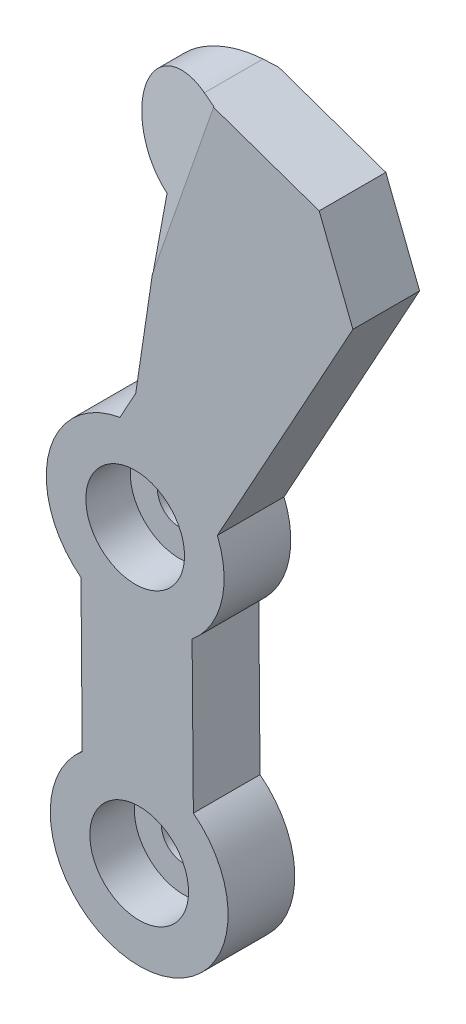
ISO-10303-21;
HEADER;
FILE_DESCRIPTION(('STEP AP214'),'2;1');
FILE_NAME('part.step','',(''),(''),'','','');
FILE_SCHEMA(('AUTOMOTIVE_DESIGN { 1 0 10303 214 1 1 1 1 }'));
ENDSEC;
DATA;
#1=APPLICATION_CONTEXT('core data for automotive mechanical design processes');
#2=APPLICATION_PROTOCOL_DEFINITION('international standard','automotive_design',2000,#1);
#3=PRODUCT_CONTEXT('',#1,'mechanical');
#4=PRODUCT('Part','Part','',(#3));
#5=PRODUCT_RELATED_PRODUCT_CATEGORY('part','',(#4));
#6=PRODUCT_DEFINITION_FORMATION('','',#4);
#7=PRODUCT_DEFINITION_CONTEXT('part definition',#1,'design');
#8=PRODUCT_DEFINITION('design','',#6,#7);
#9=PRODUCT_DEFINITION_SHAPE('','',#8);
#10=(LENGTH_UNIT() NAMED_UNIT(*) SI_UNIT(.MILLI.,.METRE.));
#11=(NAMED_UNIT(*) PLANE_ANGLE_UNIT() SI_UNIT($,.RADIAN.));
#12=(NAMED_UNIT(*) SI_UNIT($,.STERADIAN.) SOLID_ANGLE_UNIT());
#13=UNCERTAINTY_MEASURE_WITH_UNIT(LENGTH_MEASURE(1.E-05),#10,'distance_accuracy_value','');
#14=(GEOMETRIC_REPRESENTATION_CONTEXT(3) GLOBAL_UNCERTAINTY_ASSIGNED_CONTEXT((#13)) GLOBAL_UNIT_ASSIGNED_CONTEXT((#10,
#11,#12)) REPRESENTATION_CONTEXT('',''));
#15=CARTESIAN_POINT('',(0.,0.,0.));
#16=DIRECTION('',(0.,0.,1.));
#17=DIRECTION('',(1.,0.,0.));
#18=AXIS2_PLACEMENT_3D('',#15,#16,#17);
#19=CARTESIAN_POINT('',(40.5387405240071,99.7887515998659,15.));
#20=DIRECTION('',(-0.329855903742735,-0.944031293319275,0.));
#21=DIRECTION('',(0.944031293319275,-0.329855903742735,0.));
#22=AXIS2_PLACEMENT_3D('',#19,#20,#21);
#23=PLANE('',#22);
#24=DIRECTION('',(0.350651647617486,-0.122521908905224,0.928456678505445));
#25=VECTOR('',#24,1.);
#26=CARTESIAN_POINT('',(12.7019287820053,109.515268887433,-9.1993788166737));
#27=LINE('',#26,#25);
#28=CARTESIAN_POINT('',(16.1762721884382,108.301291456439,0.));
#29=VERTEX_POINT('',#28);
#30=CARTESIAN_POINT('',(16.2084452581801,108.290049798381,0.085187968380751));
#31=VERTEX_POINT('',#30);
#32=EDGE_CURVE('E56',#29,#31,#27,.T.);
#33=ORIENTED_EDGE('',*,*,#32,.T.);
#34=DIRECTION('',(-0.876492159000414,0.306256916774391,0.371440703395087));
#35=VECTOR('',#34,1.);
#36=CARTESIAN_POINT('',(16.2084452581801,108.290049798381,0.085187968380751));
#37=LINE('',#36,#35);
#38=CARTESIAN_POINT('',(13.9405368470469,109.082484311786,1.04628441039305));
#39=VERTEX_POINT('',#38);
#40=EDGE_CURVE('E164',#31,#39,#37,.T.);
#41=ORIENTED_EDGE('',*,*,#40,.T.);
#42=DIRECTION('',(0.,0.,-1.));
#43=VECTOR('',#42,1.);
#44=CARTESIAN_POINT('',(13.9405368470313,109.082484311791,15.));
#45=LINE('',#44,#43);
#46=CARTESIAN_POINT('',(13.9405368470469,109.082484311786,14.20433006524));
#47=VERTEX_POINT('',#46);
#48=EDGE_CURVE('E163',#47,#39,#45,.T.);
#49=ORIENTED_EDGE('',*,*,#48,.F.);
#50=DIRECTION('',(0.921073236849906,-0.321834082306866,0.219196067082723));
#51=VECTOR('',#50,1.);
#52=CARTESIAN_POINT('',(-0.0491900635557138,113.970663385792,10.8750691599369));
#53=LINE('',#52,#51);
#54=CARTESIAN_POINT('',(16.8139855879223,108.078466714077,14.8881504584129));
#55=VERTEX_POINT('',#54);
#56=EDGE_CURVE('E148',#47,#55,#53,.T.);
#57=ORIENTED_EDGE('',*,*,#56,.T.);
#58=DIRECTION('',(-0.206927946698601,0.0723031168044244,0.975680831099734));
#59=VECTOR('',#58,1.);
#60=CARTESIAN_POINT('',(16.8139855879223,108.078466714077,14.8881504584129));
#61=LINE('',#60,#59);
#62=CARTESIAN_POINT('',(16.7902639002125,108.086755357466,15.));
#63=VERTEX_POINT('',#62);
#64=EDGE_CURVE('E154',#55,#63,#61,.T.);
#65=ORIENTED_EDGE('',*,*,#64,.T.);
#66=DIRECTION('',(-0.944031293319275,0.329855903742735,0.));
#67=VECTOR('',#66,1.);
#68=CARTESIAN_POINT('',(40.5387405240071,99.7887515998659,15.));
#69=LINE('',#68,#67);
#70=CARTESIAN_POINT('',(40.5387405240071,99.7887515998659,15.));
#71=VERTEX_POINT('',#70);
#72=EDGE_CURVE('E209',#71,#63,#69,.T.);
#73=ORIENTED_EDGE('',*,*,#72,.F.);
#74=DIRECTION('',(0.,0.,-1.));
#75=VECTOR('',#74,1.);
#76=CARTESIAN_POINT('',(40.5387405240071,99.7887515998659,15.));
#77=LINE('',#76,#75);
#78=CARTESIAN_POINT('',(40.5387405240071,99.7887515998659,0.));
#79=VERTEX_POINT('',#78);
#80=EDGE_CURVE('E279',#71,#79,#77,.T.);
#81=ORIENTED_EDGE('',*,*,#80,.T.);
#82=DIRECTION('',(-0.944031293319275,0.329855903742735,0.));
#83=VECTOR('',#82,1.);
#84=CARTESIAN_POINT('',(40.5387405240071,99.7887515998659,0.));
#85=LINE('',#84,#83);
#86=EDGE_CURVE('E231',#79,#29,#85,.T.);
#87=ORIENTED_EDGE('',*,*,#86,.T.);
#88=EDGE_LOOP('',(#33,#41,#49,#57,#65,#73,#81,#87));
#89=FACE_BOUND('',#88,.T.);
#90=ADVANCED_FACE('F33',(#89),#23,.F.);
#91=CARTESIAN_POINT('',(9.84138893483783,97.1588665920305,15.));
#92=DIRECTION('',(0.,0.,-1.));
#93=DIRECTION('',(-1.,0.,0.));
#94=AXIS2_PLACEMENT_3D('',#91,#92,#93);
#95=CYLINDRICAL_SURFACE('',#94,12.6085555529975);
#96=CARTESIAN_POINT('',(9.84138893483783,97.1588665920305,1.0209397331653));
#97=DIRECTION('',(-0.350651647617486,0.122521908905224,-0.928456678505445));
#98=DIRECTION('',(0.876492159000414,-0.306256916774391,-0.371440703395087));
#99=AXIS2_PLACEMENT_3D('',#96,#97,#98);
#100=ELLIPSE('',#99,13.5801226324246,12.6085555529975);
#101=CARTESIAN_POINT('',(5.30776865440436,85.3935803530193,1.18057679067951));
#102=VERTEX_POINT('',#101);
#103=EDGE_CURVE('E179',#102,#39,#100,.T.);
#104=ORIENTED_EDGE('',*,*,#103,.F.);
#105=DIRECTION('',(0.,0.,-1.));
#106=VECTOR('',#105,1.);
#107=CARTESIAN_POINT('',(5.30776865440436,85.3935803530193,15.));
#108=LINE('',#107,#106);
#109=CARTESIAN_POINT('',(5.30776865440436,85.3935803530193,14.1289166675553));
#110=VERTEX_POINT('',#109);
#111=EDGE_CURVE('E275',#110,#102,#108,.T.);
#112=ORIENTED_EDGE('',*,*,#111,.F.);
#113=CARTESIAN_POINT('',(9.84138893483783,97.1588665920305,14.2185626540056));
#114=DIRECTION('',(-0.206927946698601,0.0723031168044247,0.975680831099733));
#115=DIRECTION('',(-0.921073236849907,0.321834082306865,-0.219196067082723));
#116=AXIS2_PLACEMENT_3D('',#113,#114,#115);
#117=ELLIPSE('',#116,12.9228279895443,12.6085555529975);
#118=EDGE_CURVE('E175',#47,#110,#117,.T.);
#119=ORIENTED_EDGE('',*,*,#118,.F.);
#120=ORIENTED_EDGE('',*,*,#48,.T.);
#121=EDGE_LOOP('',(#104,#112,#119,#120));
#122=FACE_BOUND('',#121,.T.);
#123=ADVANCED_FACE('F347',(#122),#95,.T.);
#124=CARTESIAN_POINT('',(5.50581694547402,85.3260122167898,15.));
#125=DIRECTION('',(0.322895145350246,0.946434744242435,0.));
#126=DIRECTION('',(-0.946434744242435,0.322895145350246,0.));
#127=AXIS2_PLACEMENT_3D('',#124,#125,#126);
#128=PLANE('',#127);
#129=DIRECTION('',(-0.878726946270524,0.299795275654544,0.371432021496931));
#130=VECTOR('',#129,1.);
#131=CARTESIAN_POINT('',(0.968009269216061,86.8741760792329,3.01496414854087));
#132=LINE('',#131,#130);
#133=CARTESIAN_POINT('',(5.50581694547402,85.3260122167898,1.09686309848169));
#134=VERTEX_POINT('',#133);
#135=EDGE_CURVE('E177',#134,#102,#132,.T.);
#136=ORIENTED_EDGE('',*,*,#135,.F.);
#137=DIRECTION('',(0.,0.,-1.));
#138=VECTOR('',#137,1.);
#139=CARTESIAN_POINT('',(5.50581694547402,85.3260122167898,15.));
#140=LINE('',#139,#138);
#141=CARTESIAN_POINT('',(5.50581694547403,85.3260122167898,14.1759270336528));
#142=VERTEX_POINT('',#141);
#143=EDGE_CURVE('E272',#142,#134,#140,.T.);
#144=ORIENTED_EDGE('',*,*,#143,.F.);
#145=DIRECTION('',(0.92341944082408,-0.315043014194074,0.219190409269329));
#146=VECTOR('',#145,1.);
#147=CARTESIAN_POINT('',(5.67261317477762,85.2691063465937,14.2155191541447));
#148=LINE('',#147,#146);
#149=EDGE_CURVE('E173',#110,#142,#148,.T.);
#150=ORIENTED_EDGE('',*,*,#149,.F.);
#151=ORIENTED_EDGE('',*,*,#111,.T.);
#152=EDGE_LOOP('',(#136,#144,#150,#151));
#153=FACE_BOUND('',#152,.T.);
#154=ADVANCED_FACE('F343',(#153),#128,.F.);
#155=CARTESIAN_POINT('',(5.50581694547402,85.3260122167898,15.));
#156=DIRECTION('',(0.989057231211688,-0.147532346920497,0.));
#157=DIRECTION('',(0.147532346920497,0.989057231211688,0.));
#158=AXIS2_PLACEMENT_3D('',#155,#156,#157);
#159=PLANE('',#158);
#160=DIRECTION('',(-0.133656048191534,-0.896030489030661,0.423397476975593));
#161=VECTOR('',#160,1.);
#162=CARTESIAN_POINT('',(4.3040904643151,77.2696348125225,-2.42896025397282));
#163=LINE('',#162,#161);
#164=CARTESIAN_POINT('',(3.53732815132414,72.129258304495,0.));
#165=VERTEX_POINT('',#164);
#166=CARTESIAN_POINT('',(3.51043642941656,71.9489761320248,0.0851879683807523));
#167=VERTEX_POINT('',#166);
#168=EDGE_CURVE('E169',#165,#167,#163,.T.);
#169=ORIENTED_EDGE('',*,*,#168,.F.);
#170=DIRECTION('',(-0.147532346920497,-0.989057231211688,0.));
#171=VECTOR('',#170,1.);
#172=CARTESIAN_POINT('',(5.50581694547402,85.3260122167898,0.));
#173=LINE('',#172,#171);
#174=CARTESIAN_POINT('',(-0.715580359542119,43.6177487667205,0.));
#175=VERTEX_POINT('',#174);
#176=EDGE_CURVE('E234',#165,#175,#173,.T.);
#177=ORIENTED_EDGE('',*,*,#176,.T.);
#178=DIRECTION('',(0.,0.,-1.));
#179=VECTOR('',#178,1.);
#180=CARTESIAN_POINT('',(-0.715580359542119,43.6177487667205,15.));
#181=LINE('',#180,#179);
#182=CARTESIAN_POINT('',(-0.715580359542119,43.6177487667205,15.));
#183=VERTEX_POINT('',#182);
#184=EDGE_CURVE('E269',#183,#175,#181,.T.);
#185=ORIENTED_EDGE('',*,*,#184,.F.);
#186=DIRECTION('',(-0.147532346920497,-0.989057231211688,0.));
#187=VECTOR('',#186,1.);
#188=CARTESIAN_POINT('',(5.50581694547402,85.3260122167898,15.));
#189=LINE('',#188,#187);
#190=CARTESIAN_POINT('',(3.02412582095592,68.6887485686951,15.));
#191=VERTEX_POINT('',#190);
#192=EDGE_CURVE('E212',#191,#183,#189,.T.);
#193=ORIENTED_EDGE('',*,*,#192,.F.);
#194=DIRECTION('',(0.113398313657849,0.760222584888087,0.639689333884528));
#195=VECTOR('',#194,1.);
#196=CARTESIAN_POINT('',(4.49030287235196,78.5180032724199,23.2708268854346));
#197=LINE('',#196,#195);
#198=CARTESIAN_POINT('',(3.00429815035474,68.5558238142562,14.8881504584129));
#199=VERTEX_POINT('',#198);
#200=EDGE_CURVE('E48',#199,#191,#197,.T.);
#201=ORIENTED_EDGE('',*,*,#200,.F.);
#202=DIRECTION('',(-0.14740236513958,-0.988185833019865,0.0419678706881108));
#203=VECTOR('',#202,1.);
#204=CARTESIAN_POINT('',(5.50071909545126,85.2918362171944,14.1773784751567));
#205=LINE('',#204,#203);
#206=EDGE_CURVE('E41',#142,#199,#205,.T.);
#207=ORIENTED_EDGE('',*,*,#206,.F.);
#208=ORIENTED_EDGE('',*,*,#143,.T.);
#209=DIRECTION('',(0.147121344217173,0.986301868037063,0.0745917903145677));
#210=VECTOR('',#209,1.);
#211=CARTESIAN_POINT('',(5.65839058794591,86.348866306276,1.17421925103283));
#212=LINE('',#211,#210);
#213=EDGE_CURVE('E11',#167,#134,#212,.T.);
#214=ORIENTED_EDGE('',*,*,#213,.F.);
#215=EDGE_LOOP('',(#169,#177,#185,#193,#201,#207,#208,#214));
#216=FACE_BOUND('',#215,.T.);
#217=ADVANCED_FACE('F290',(#216),#159,.F.);
#218=CARTESIAN_POINT('',(-0.839707243672549,17.4582706729418,15.));
#219=DIRECTION('',(0.,0.,1.));
#220=DIRECTION('',(1.,0.,0.));
#221=AXIS2_PLACEMENT_3D('',#218,#219,#220);
#222=PLANE('',#221);
#223=CARTESIAN_POINT('',(-0.839707243672549,17.4582706729418,15.));
#224=DIRECTION('',(0.,0.,1.));
#225=DIRECTION('',(1.,0.,0.));
#226=AXIS2_PLACEMENT_3D('',#223,#224,#225);
#227=CIRCLE('',#226,11.1);
#228=CARTESIAN_POINT('',(10.2602927563275,17.4582706729418,15.));
#229=VERTEX_POINT('',#228);
#230=EDGE_CURVE('E197',#229,#229,#227,.T.);
#231=ORIENTED_EDGE('',*,*,#230,.F.);
#232=EDGE_LOOP('',(#231));
#233=FACE_BOUND('',#232,.T.);
#234=CARTESIAN_POINT('',(0.0627733290771951,-47.5417293270582,15.));
#235=DIRECTION('',(0.,0.,1.));
#236=DIRECTION('',(1.,0.,0.));
#237=AXIS2_PLACEMENT_3D('',#234,#235,#236);
#238=CIRCLE('',#237,11.1);
#239=CARTESIAN_POINT('',(11.1627733290772,-47.5417293270582,15.));
#240=VERTEX_POINT('',#239);
#241=EDGE_CURVE('E193',#240,#240,#238,.T.);
#242=ORIENTED_EDGE('',*,*,#241,.F.);
#243=EDGE_LOOP('',(#242));
#244=FACE_BOUND('',#243,.T.);
#245=ORIENTED_EDGE('',*,*,#72,.T.);
#246=DIRECTION('',(-0.329855903742735,-0.944031293319275,0.));
#247=VECTOR('',#246,1.);
#248=CARTESIAN_POINT('',(-13.3491567841864,21.8292230054667,15.));
#249=LINE('',#248,#247);
#250=EDGE_CURVE('E156',#63,#191,#249,.T.);
#251=ORIENTED_EDGE('',*,*,#250,.T.);
#252=ORIENTED_EDGE('',*,*,#192,.T.);
#253=DIRECTION('',(-0.48233631116927,-0.87598612028252,0.));
#254=VECTOR('',#253,1.);
#255=CARTESIAN_POINT('',(-4.27033710901568,37.1618434131079,15.));
#256=LINE('',#255,#254);
#257=CARTESIAN_POINT('',(-4.27033710901568,37.1618434131079,15.));
#258=VERTEX_POINT('',#257);
#259=EDGE_CURVE('E214',#183,#258,#256,.T.);
#260=ORIENTED_EDGE('',*,*,#259,.T.);
#261=CARTESIAN_POINT('',(-0.839707243672549,17.4582706729418,15.));
#262=DIRECTION('',(0.,0.,1.));
#263=DIRECTION('',(1.,0.,0.));
#264=AXIS2_PLACEMENT_3D('',#261,#262,#263);
#265=CIRCLE('',#264,20.);
#266=CARTESIAN_POINT('',(-13.0309125696976,1.60347604485852,15.));
#267=VERTEX_POINT('',#266);
#268=EDGE_CURVE('E216',#258,#267,#265,.T.);
#269=ORIENTED_EDGE('',*,*,#268,.T.);
#270=DIRECTION('',(0.0082766551301162,-0.999965747903325,0.));
#271=VECTOR('',#270,1.);
#272=CARTESIAN_POINT('',(-13.0309125696976,1.60347604485852,15.));
#273=LINE('',#272,#271);
#274=CARTESIAN_POINT('',(-12.7512398622865,-32.1859139487867,15.));
#275=VERTEX_POINT('',#274);
#276=EDGE_CURVE('E218',#267,#275,#273,.T.);
#277=ORIENTED_EDGE('',*,*,#276,.T.);
#278=CARTESIAN_POINT('',(0.0627733290771949,-47.5417293270582,15.));
#279=DIRECTION('',(0.,0.,1.));
#280=DIRECTION('',(1.,0.,0.));
#281=AXIS2_PLACEMENT_3D('',#278,#279,#280);
#282=CIRCLE('',#281,20.0000000000001);
#283=CARTESIAN_POINT('',(12.2436198655101,-31.6789749112619,15.));
#284=VERTEX_POINT('',#283);
#285=EDGE_CURVE('E220',#275,#284,#282,.T.);
#286=ORIENTED_EDGE('',*,*,#285,.T.);
#287=DIRECTION('',(-0.00827085395216305,0.999965795902491,0.));
#288=VECTOR('',#287,1.);
#289=CARTESIAN_POINT('',(11.9642781989979,2.09409296035713,15.));
#290=LINE('',#289,#288);
#291=CARTESIAN_POINT('',(11.9642781989979,2.09409296035713,15.));
#292=VERTEX_POINT('',#291);
#293=EDGE_CURVE('E222',#284,#292,#290,.T.);
#294=ORIENTED_EDGE('',*,*,#293,.T.);
#295=CARTESIAN_POINT('',(-0.839707243672549,17.4582706729418,15.));
#296=DIRECTION('',(0.,0.,1.));
#297=DIRECTION('',(1.,0.,0.));
#298=AXIS2_PLACEMENT_3D('',#295,#296,#297);
#299=CIRCLE('',#298,20.);
#300=CARTESIAN_POINT('',(17.6362151559132,25.1159655927259,15.));
#301=VERTEX_POINT('',#300);
#302=EDGE_CURVE('E224',#292,#301,#299,.T.);
#303=ORIENTED_EDGE('',*,*,#302,.T.);
#304=DIRECTION('',(0.482336311169269,0.87598612028252,0.));
#305=VECTOR('',#304,1.);
#306=CARTESIAN_POINT('',(17.6362151559132,25.1159655927259,15.));
#307=LINE('',#306,#305);
#308=CARTESIAN_POINT('',(48.1292087035365,80.4952486677015,15.));
#309=VERTEX_POINT('',#308);
#310=EDGE_CURVE('E226',#301,#309,#307,.T.);
#311=ORIENTED_EDGE('',*,*,#310,.T.);
#312=DIRECTION('',(-0.36610684099222,0.930572824113565,0.));
#313=VECTOR('',#312,1.);
#314=CARTESIAN_POINT('',(40.5387405240071,99.7887515998659,15.));
#315=LINE('',#314,#313);
#316=EDGE_CURVE('E206',#309,#71,#315,.T.);
#317=ORIENTED_EDGE('',*,*,#316,.T.);
#318=EDGE_LOOP('',(#245,#251,#252,#260,#269,#277,#286,#294,#303,#311,#317));
#319=FACE_BOUND('',#318,.T.);
#320=ADVANCED_FACE('F286',(#233,#244,#319),#222,.T.);
#321=CARTESIAN_POINT('',(-0.839707243672549,17.4582706729418,0.));
#322=DIRECTION('',(0.,0.,1.));
#323=DIRECTION('',(1.,0.,0.));
#324=AXIS2_PLACEMENT_3D('',#321,#322,#323);
#325=PLANE('',#324);
#326=CARTESIAN_POINT('',(-0.839707243672549,17.4582706729418,0.));
#327=DIRECTION('',(0.,0.,1.));
#328=DIRECTION('',(1.,0.,0.));
#329=AXIS2_PLACEMENT_3D('',#326,#327,#328);
#330=CIRCLE('',#329,5.);
#331=CARTESIAN_POINT('',(4.16029275632745,17.4582706729418,0.));
#332=VERTEX_POINT('',#331);
#333=EDGE_CURVE('E190',#332,#332,#330,.T.);
#334=ORIENTED_EDGE('',*,*,#333,.T.);
#335=EDGE_LOOP('',(#334));
#336=FACE_BOUND('',#335,.T.);
#337=CARTESIAN_POINT('',(0.0627733290771951,-47.5417293270582,0.));
#338=DIRECTION('',(0.,0.,1.));
#339=DIRECTION('',(1.,0.,0.));
#340=AXIS2_PLACEMENT_3D('',#337,#338,#339);
#341=CIRCLE('',#340,5.);
#342=CARTESIAN_POINT('',(5.0627733290772,-47.5417293270582,0.));
#343=VERTEX_POINT('',#342);
#344=EDGE_CURVE('E184',#343,#343,#341,.T.);
#345=ORIENTED_EDGE('',*,*,#344,.T.);
#346=EDGE_LOOP('',(#345));
#347=FACE_BOUND('',#346,.T.);
#348=DIRECTION('',(-0.329855903742735,-0.944031293319275,0.));
#349=VECTOR('',#348,1.);
#350=CARTESIAN_POINT('',(-13.9631484959607,22.0437591044404,0.));
#351=LINE('',#350,#349);
#352=EDGE_CURVE('E282',#29,#165,#351,.T.);
#353=ORIENTED_EDGE('',*,*,#352,.F.);
#354=ORIENTED_EDGE('',*,*,#86,.F.);
#355=DIRECTION('',(-0.36610684099222,0.930572824113565,0.));
#356=VECTOR('',#355,1.);
#357=CARTESIAN_POINT('',(40.5387405240071,99.7887515998659,0.));
#358=LINE('',#357,#356);
#359=CARTESIAN_POINT('',(48.1292087035365,80.4952486677015,0.));
#360=VERTEX_POINT('',#359);
#361=EDGE_CURVE('E203',#360,#79,#358,.T.);
#362=ORIENTED_EDGE('',*,*,#361,.F.);
#363=DIRECTION('',(0.482336311169269,0.87598612028252,0.));
#364=VECTOR('',#363,1.);
#365=CARTESIAN_POINT('',(17.6362151559132,25.1159655927259,0.));
#366=LINE('',#365,#364);
#367=CARTESIAN_POINT('',(17.6362151559132,25.1159655927259,0.));
#368=VERTEX_POINT('',#367);
#369=EDGE_CURVE('E210',#368,#360,#366,.T.);
#370=ORIENTED_EDGE('',*,*,#369,.F.);
#371=CARTESIAN_POINT('',(-0.839707243672549,17.4582706729418,0.));
#372=DIRECTION('',(0.,0.,1.));
#373=DIRECTION('',(1.,0.,0.));
#374=AXIS2_PLACEMENT_3D('',#371,#372,#373);
#375=CIRCLE('',#374,20.);
#376=CARTESIAN_POINT('',(11.9642781989979,2.09409296035713,0.));
#377=VERTEX_POINT('',#376);
#378=EDGE_CURVE('E246',#377,#368,#375,.T.);
#379=ORIENTED_EDGE('',*,*,#378,.F.);
#380=DIRECTION('',(-0.00827085395216305,0.999965795902491,0.));
#381=VECTOR('',#380,1.);
#382=CARTESIAN_POINT('',(11.9642781989979,2.09409296035713,0.));
#383=LINE('',#382,#381);
#384=CARTESIAN_POINT('',(12.2436198655101,-31.6789749112619,0.));
#385=VERTEX_POINT('',#384);
#386=EDGE_CURVE('E244',#385,#377,#383,.T.);
#387=ORIENTED_EDGE('',*,*,#386,.F.);
#388=CARTESIAN_POINT('',(0.0627733290771949,-47.5417293270582,0.));
#389=DIRECTION('',(0.,0.,1.));
#390=DIRECTION('',(1.,0.,0.));
#391=AXIS2_PLACEMENT_3D('',#388,#389,#390);
#392=CIRCLE('',#391,20.0000000000001);
#393=CARTESIAN_POINT('',(-12.7512398622865,-32.1859139487867,0.));
#394=VERTEX_POINT('',#393);
#395=EDGE_CURVE('E242',#394,#385,#392,.T.);
#396=ORIENTED_EDGE('',*,*,#395,.F.);
#397=DIRECTION('',(0.0082766551301162,-0.999965747903325,0.));
#398=VECTOR('',#397,1.);
#399=CARTESIAN_POINT('',(-13.0309125696976,1.60347604485852,0.));
#400=LINE('',#399,#398);
#401=CARTESIAN_POINT('',(-13.0309125696976,1.60347604485852,0.));
#402=VERTEX_POINT('',#401);
#403=EDGE_CURVE('E240',#402,#394,#400,.T.);
#404=ORIENTED_EDGE('',*,*,#403,.F.);
#405=CARTESIAN_POINT('',(-0.839707243672549,17.4582706729418,0.));
#406=DIRECTION('',(0.,0.,1.));
#407=DIRECTION('',(1.,0.,0.));
#408=AXIS2_PLACEMENT_3D('',#405,#406,#407);
#409=CIRCLE('',#408,20.);
#410=CARTESIAN_POINT('',(-4.27033710901568,37.1618434131079,0.));
#411=VERTEX_POINT('',#410);
#412=EDGE_CURVE('E238',#411,#402,#409,.T.);
#413=ORIENTED_EDGE('',*,*,#412,.F.);
#414=DIRECTION('',(-0.48233631116927,-0.87598612028252,0.));
#415=VECTOR('',#414,1.);
#416=CARTESIAN_POINT('',(-4.27033710901568,37.1618434131079,0.));
#417=LINE('',#416,#415);
#418=EDGE_CURVE('E236',#175,#411,#417,.T.);
#419=ORIENTED_EDGE('',*,*,#418,.F.);
#420=ORIENTED_EDGE('',*,*,#176,.F.);
#421=EDGE_LOOP('',(#353,#354,#362,#370,#379,#387,#396,#404,#413,#419,#420));
#422=FACE_BOUND('',#421,.T.);
#423=ADVANCED_FACE('F332',(#336,#347,#422),#325,.F.);
#424=CARTESIAN_POINT('',(40.5387405240071,99.7887515998659,15.));
#425=DIRECTION('',(-0.930572824113566,-0.36610684099222,0.));
#426=DIRECTION('',(0.36610684099222,-0.930572824113566,0.));
#427=AXIS2_PLACEMENT_3D('',#424,#425,#426);
#428=PLANE('',#427);
#429=ORIENTED_EDGE('',*,*,#361,.T.);
#430=ORIENTED_EDGE('',*,*,#80,.F.);
#431=ORIENTED_EDGE('',*,*,#316,.F.);
#432=DIRECTION('',(0.,0.,-1.));
#433=VECTOR('',#432,1.);
#434=CARTESIAN_POINT('',(48.1292087035365,80.4952486677015,15.));
#435=LINE('',#434,#433);
#436=EDGE_CURVE('E228',#309,#360,#435,.T.);
#437=ORIENTED_EDGE('',*,*,#436,.T.);
#438=EDGE_LOOP('',(#429,#430,#431,#437));
#439=FACE_BOUND('',#438,.T.);
#440=ADVANCED_FACE('F35',(#439),#428,.F.);
#441=CARTESIAN_POINT('',(-4.27033710901568,37.1618434131079,15.));
#442=DIRECTION('',(0.87598612028252,-0.48233631116927,0.));
#443=DIRECTION('',(0.48233631116927,0.87598612028252,0.));
#444=AXIS2_PLACEMENT_3D('',#441,#442,#443);
#445=PLANE('',#444);
#446=ORIENTED_EDGE('',*,*,#418,.T.);
#447=DIRECTION('',(0.,0.,-1.));
#448=VECTOR('',#447,1.);
#449=CARTESIAN_POINT('',(-4.27033710901568,37.1618434131079,15.));
#450=LINE('',#449,#448);
#451=EDGE_CURVE('E266',#258,#411,#450,.T.);
#452=ORIENTED_EDGE('',*,*,#451,.F.);
#453=ORIENTED_EDGE('',*,*,#259,.F.);
#454=ORIENTED_EDGE('',*,*,#184,.T.);
#455=EDGE_LOOP('',(#446,#452,#453,#454));
#456=FACE_BOUND('',#455,.T.);
#457=ADVANCED_FACE('F296',(#456),#445,.F.);
#458=CARTESIAN_POINT('',(-0.839707243672549,17.4582706729418,15.));
#459=DIRECTION('',(0.,0.,-1.));
#460=DIRECTION('',(-1.,0.,0.));
#461=AXIS2_PLACEMENT_3D('',#458,#459,#460);
#462=CYLINDRICAL_SURFACE('',#461,20.);
#463=ORIENTED_EDGE('',*,*,#412,.T.);
#464=DIRECTION('',(0.,0.,-1.));
#465=VECTOR('',#464,1.);
#466=CARTESIAN_POINT('',(-13.0309125696976,1.60347604485852,15.));
#467=LINE('',#466,#465);
#468=EDGE_CURVE('E263',#267,#402,#467,.T.);
#469=ORIENTED_EDGE('',*,*,#468,.F.);
#470=ORIENTED_EDGE('',*,*,#268,.F.);
#471=ORIENTED_EDGE('',*,*,#451,.T.);
#472=EDGE_LOOP('',(#463,#469,#470,#471));
#473=FACE_BOUND('',#472,.T.);
#474=ADVANCED_FACE('F302',(#473),#462,.T.);
#475=CARTESIAN_POINT('',(-13.0309125696976,1.60347604485852,15.));
#476=DIRECTION('',(0.999965747903325,0.0082766551301162,0.));
#477=DIRECTION('',(-0.0082766551301162,0.999965747903326,0.));
#478=AXIS2_PLACEMENT_3D('',#475,#476,#477);
#479=PLANE('',#478);
#480=ORIENTED_EDGE('',*,*,#403,.T.);
#481=DIRECTION('',(0.,0.,-1.));
#482=VECTOR('',#481,1.);
#483=CARTESIAN_POINT('',(-12.7512398622865,-32.1859139487867,15.));
#484=LINE('',#483,#482);
#485=EDGE_CURVE('E260',#275,#394,#484,.T.);
#486=ORIENTED_EDGE('',*,*,#485,.F.);
#487=ORIENTED_EDGE('',*,*,#276,.F.);
#488=ORIENTED_EDGE('',*,*,#468,.T.);
#489=EDGE_LOOP('',(#480,#486,#487,#488));
#490=FACE_BOUND('',#489,.T.);
#491=ADVANCED_FACE('F306',(#490),#479,.F.);
#492=CARTESIAN_POINT('',(0.0627733290771949,-47.5417293270582,15.));
#493=DIRECTION('',(0.,0.,-1.));
#494=DIRECTION('',(-1.,0.,0.));
#495=AXIS2_PLACEMENT_3D('',#492,#493,#494);
#496=CYLINDRICAL_SURFACE('',#495,20.0000000000001);
#497=ORIENTED_EDGE('',*,*,#395,.T.);
#498=DIRECTION('',(0.,0.,-1.));
#499=VECTOR('',#498,1.);
#500=CARTESIAN_POINT('',(12.2436198655101,-31.6789749112619,15.));
#501=LINE('',#500,#499);
#502=EDGE_CURVE('E257',#284,#385,#501,.T.);
#503=ORIENTED_EDGE('',*,*,#502,.F.);
#504=ORIENTED_EDGE('',*,*,#285,.F.);
#505=ORIENTED_EDGE('',*,*,#485,.T.);
#506=EDGE_LOOP('',(#497,#503,#504,#505));
#507=FACE_BOUND('',#506,.T.);
#508=ADVANCED_FACE('F311',(#507),#496,.T.);
#509=CARTESIAN_POINT('',(11.9642781989979,2.09409296035713,15.));
#510=DIRECTION('',(-0.999965795902491,-0.00827085395216305,0.));
#511=DIRECTION('',(0.00827085395216305,-0.999965795902491,0.));
#512=AXIS2_PLACEMENT_3D('',#509,#510,#511);
#513=PLANE('',#512);
#514=ORIENTED_EDGE('',*,*,#386,.T.);
#515=DIRECTION('',(0.,0.,-1.));
#516=VECTOR('',#515,1.);
#517=CARTESIAN_POINT('',(11.9642781989979,2.09409296035713,15.));
#518=LINE('',#517,#516);
#519=EDGE_CURVE('E254',#292,#377,#518,.T.);
#520=ORIENTED_EDGE('',*,*,#519,.F.);
#521=ORIENTED_EDGE('',*,*,#293,.F.);
#522=ORIENTED_EDGE('',*,*,#502,.T.);
#523=EDGE_LOOP('',(#514,#520,#521,#522));
#524=FACE_BOUND('',#523,.T.);
#525=ADVANCED_FACE('F317',(#524),#513,.F.);
#526=CARTESIAN_POINT('',(-0.839707243672549,17.4582706729418,15.));
#527=DIRECTION('',(0.,0.,-1.));
#528=DIRECTION('',(-1.,0.,0.));
#529=AXIS2_PLACEMENT_3D('',#526,#527,#528);
#530=CYLINDRICAL_SURFACE('',#529,20.);
#531=ORIENTED_EDGE('',*,*,#378,.T.);
#532=DIRECTION('',(0.,0.,-1.));
#533=VECTOR('',#532,1.);
#534=CARTESIAN_POINT('',(17.6362151559132,25.1159655927259,15.));
#535=LINE('',#534,#533);
#536=EDGE_CURVE('E251',#301,#368,#535,.T.);
#537=ORIENTED_EDGE('',*,*,#536,.F.);
#538=ORIENTED_EDGE('',*,*,#302,.F.);
#539=ORIENTED_EDGE('',*,*,#519,.T.);
#540=EDGE_LOOP('',(#531,#537,#538,#539));
#541=FACE_BOUND('',#540,.T.);
#542=ADVANCED_FACE('F321',(#541),#530,.T.);
#543=CARTESIAN_POINT('',(17.6362151559132,25.1159655927259,15.));
#544=DIRECTION('',(-0.87598612028252,0.482336311169269,0.));
#545=DIRECTION('',(-0.482336311169269,-0.87598612028252,0.));
#546=AXIS2_PLACEMENT_3D('',#543,#544,#545);
#547=PLANE('',#546);
#548=ORIENTED_EDGE('',*,*,#369,.T.);
#549=ORIENTED_EDGE('',*,*,#436,.F.);
#550=ORIENTED_EDGE('',*,*,#310,.F.);
#551=ORIENTED_EDGE('',*,*,#536,.T.);
#552=EDGE_LOOP('',(#548,#549,#550,#551));
#553=FACE_BOUND('',#552,.T.);
#554=ADVANCED_FACE('F326',(#553),#547,.F.);
#555=CARTESIAN_POINT('',(-0.839707243672549,17.4582706729418,5.));
#556=DIRECTION('',(0.,0.,1.));
#557=DIRECTION('',(1.,0.,0.));
#558=AXIS2_PLACEMENT_3D('',#555,#556,#557);
#559=CYLINDRICAL_SURFACE('',#558,11.1);
#560=CARTESIAN_POINT('',(-0.839707243672549,17.4582706729418,5.));
#561=DIRECTION('',(0.,0.,1.));
#562=DIRECTION('',(1.,0.,0.));
#563=AXIS2_PLACEMENT_3D('',#560,#561,#562);
#564=CIRCLE('',#563,11.1);
#565=CARTESIAN_POINT('',(10.2602927563275,17.4582706729418,5.));
#566=VERTEX_POINT('',#565);
#567=EDGE_CURVE('E200',#566,#566,#564,.T.);
#568=ORIENTED_EDGE('',*,*,#567,.F.);
#569=EDGE_LOOP('',(#568));
#570=FACE_BOUND('',#569,.T.);
#571=ORIENTED_EDGE('',*,*,#230,.T.);
#572=EDGE_LOOP('',(#571));
#573=FACE_BOUND('',#572,.T.);
#574=ADVANCED_FACE('F372',(#570,#573),#559,.F.);
#575=CARTESIAN_POINT('',(-0.839707243672549,17.4582706729418,5.));
#576=DIRECTION('',(0.,0.,1.));
#577=DIRECTION('',(1.,0.,0.));
#578=AXIS2_PLACEMENT_3D('',#575,#576,#577);
#579=PLANE('',#578);
#580=CARTESIAN_POINT('',(-0.839707243672549,17.4582706729418,5.));
#581=DIRECTION('',(0.,0.,1.));
#582=DIRECTION('',(1.,0.,0.));
#583=AXIS2_PLACEMENT_3D('',#580,#581,#582);
#584=CIRCLE('',#583,5.);
#585=CARTESIAN_POINT('',(4.16029275632745,17.4582706729418,5.));
#586=VERTEX_POINT('',#585);
#587=EDGE_CURVE('E187',#586,#586,#584,.T.);
#588=ORIENTED_EDGE('',*,*,#587,.F.);
#589=EDGE_LOOP('',(#588));
#590=FACE_BOUND('',#589,.T.);
#591=ORIENTED_EDGE('',*,*,#567,.T.);
#592=EDGE_LOOP('',(#591));
#593=FACE_BOUND('',#592,.T.);
#594=ADVANCED_FACE('F381',(#590,#593),#579,.T.);
#595=CARTESIAN_POINT('',(0.0627733290771951,-47.5417293270582,5.));
#596=DIRECTION('',(0.,0.,1.));
#597=DIRECTION('',(1.,0.,0.));
#598=AXIS2_PLACEMENT_3D('',#595,#596,#597);
#599=CYLINDRICAL_SURFACE('',#598,11.1);
#600=CARTESIAN_POINT('',(0.0627733290771951,-47.5417293270582,5.));
#601=DIRECTION('',(0.,0.,1.));
#602=DIRECTION('',(1.,0.,0.));
#603=AXIS2_PLACEMENT_3D('',#600,#601,#602);
#604=CIRCLE('',#603,11.1);
#605=CARTESIAN_POINT('',(11.1627733290772,-47.5417293270582,5.));
#606=VERTEX_POINT('',#605);
#607=EDGE_CURVE('E194',#606,#606,#604,.T.);
#608=ORIENTED_EDGE('',*,*,#607,.F.);
#609=EDGE_LOOP('',(#608));
#610=FACE_BOUND('',#609,.T.);
#611=ORIENTED_EDGE('',*,*,#241,.T.);
#612=EDGE_LOOP('',(#611));
#613=FACE_BOUND('',#612,.T.);
#614=ADVANCED_FACE('F385',(#610,#613),#599,.F.);
#615=CARTESIAN_POINT('',(0.0627733290771951,-47.5417293270582,5.));
#616=DIRECTION('',(0.,0.,1.));
#617=DIRECTION('',(1.,0.,0.));
#618=AXIS2_PLACEMENT_3D('',#615,#616,#617);
#619=PLANE('',#618);
#620=CARTESIAN_POINT('',(0.0627733290771951,-47.5417293270582,5.));
#621=DIRECTION('',(0.,0.,1.));
#622=DIRECTION('',(1.,0.,0.));
#623=AXIS2_PLACEMENT_3D('',#620,#621,#622);
#624=CIRCLE('',#623,5.);
#625=CARTESIAN_POINT('',(5.0627733290772,-47.5417293270582,5.));
#626=VERTEX_POINT('',#625);
#627=EDGE_CURVE('E181',#626,#626,#624,.T.);
#628=ORIENTED_EDGE('',*,*,#627,.F.);
#629=EDGE_LOOP('',(#628));
#630=FACE_BOUND('',#629,.T.);
#631=ORIENTED_EDGE('',*,*,#607,.T.);
#632=EDGE_LOOP('',(#631));
#633=FACE_BOUND('',#632,.T.);
#634=ADVANCED_FACE('F389',(#630,#633),#619,.T.);
#635=CARTESIAN_POINT('',(-0.839707243672549,17.4582706729418,-5.));
#636=DIRECTION('',(0.,0.,1.));
#637=DIRECTION('',(1.,0.,0.));
#638=AXIS2_PLACEMENT_3D('',#635,#636,#637);
#639=CYLINDRICAL_SURFACE('',#638,5.);
#640=ORIENTED_EDGE('',*,*,#587,.T.);
#641=EDGE_LOOP('',(#640));
#642=FACE_BOUND('',#641,.T.);
#643=ORIENTED_EDGE('',*,*,#333,.F.);
#644=EDGE_LOOP('',(#643));
#645=FACE_BOUND('',#644,.T.);
#646=ADVANCED_FACE('F393',(#642,#645),#639,.F.);
#647=CARTESIAN_POINT('',(0.0627733290771951,-47.5417293270582,-5.));
#648=DIRECTION('',(0.,0.,1.));
#649=DIRECTION('',(1.,0.,0.));
#650=AXIS2_PLACEMENT_3D('',#647,#648,#649);
#651=CYLINDRICAL_SURFACE('',#650,5.);
#652=ORIENTED_EDGE('',*,*,#627,.T.);
#653=EDGE_LOOP('',(#652));
#654=FACE_BOUND('',#653,.T.);
#655=ORIENTED_EDGE('',*,*,#344,.F.);
#656=EDGE_LOOP('',(#655));
#657=FACE_BOUND('',#656,.T.);
#658=ADVANCED_FACE('F397',(#654,#657),#651,.F.);
#659=CARTESIAN_POINT('',(-8.07899315378705,50.0412974083189,-9.1993788166737));
#660=DIRECTION('',(-0.876492159000414,0.306256916774391,0.371440703395087));
#661=DIRECTION('',(0.390189751663938,0.,0.920734466443195));
#662=AXIS2_PLACEMENT_3D('',#659,#660,#661);
#663=PLANE('',#662);
#664=ORIENTED_EDGE('',*,*,#168,.T.);
#665=DIRECTION('',(0.329855903742735,0.944031293319275,0.));
#666=VECTOR('',#665,1.);
#667=CARTESIAN_POINT('',(-4.57247667761219,48.8160783192667,0.085187968380751));
#668=LINE('',#667,#666);
#669=EDGE_CURVE('E151',#167,#31,#668,.T.);
#670=ORIENTED_EDGE('',*,*,#669,.T.);
#671=ORIENTED_EDGE('',*,*,#32,.F.);
#672=ORIENTED_EDGE('',*,*,#352,.T.);
#673=EDGE_LOOP('',(#664,#670,#671,#672));
#674=FACE_BOUND('',#673,.T.);
#675=ADVANCED_FACE('F333',(#674),#663,.T.);
#676=CARTESIAN_POINT('',(-4.57247667761219,48.8160783192667,0.085187968380751));
#677=DIRECTION('',(-0.350651647617486,0.122521908905224,-0.928456678505445));
#678=DIRECTION('',(-0.935504951584411,0.,0.353313579644272));
#679=AXIS2_PLACEMENT_3D('',#676,#677,#678);
#680=PLANE('',#679);
#681=ORIENTED_EDGE('',*,*,#103,.T.);
#682=ORIENTED_EDGE('',*,*,#40,.F.);
#683=ORIENTED_EDGE('',*,*,#669,.F.);
#684=ORIENTED_EDGE('',*,*,#213,.T.);
#685=ORIENTED_EDGE('',*,*,#135,.T.);
#686=EDGE_LOOP('',(#681,#682,#683,#684,#685));
#687=FACE_BOUND('',#686,.T.);
#688=ADVANCED_FACE('F339',(#687),#680,.T.);
#689=CARTESIAN_POINT('',(-20.830111999348,54.496691906678,10.8750691599369));
#690=DIRECTION('',(-0.206927946698601,0.0723031168044247,0.975680831099733));
#691=DIRECTION('',(0.978241177299298,0.,0.207470959500561));
#692=AXIS2_PLACEMENT_3D('',#689,#690,#691);
#693=PLANE('',#692);
#694=ORIENTED_EDGE('',*,*,#118,.T.);
#695=ORIENTED_EDGE('',*,*,#149,.T.);
#696=ORIENTED_EDGE('',*,*,#206,.T.);
#697=DIRECTION('',(0.329855903742735,0.944031293319275,0.));
#698=VECTOR('',#697,1.);
#699=CARTESIAN_POINT('',(-3.96693634787002,48.6044952349629,14.8881504584129));
#700=LINE('',#699,#698);
#701=EDGE_CURVE('E144',#199,#55,#700,.T.);
#702=ORIENTED_EDGE('',*,*,#701,.T.);
#703=ORIENTED_EDGE('',*,*,#56,.F.);
#704=EDGE_LOOP('',(#694,#695,#696,#702,#703));
#705=FACE_BOUND('',#704,.T.);
#706=ADVANCED_FACE('F146',(#705),#693,.T.);
#707=CARTESIAN_POINT('',(-3.96693634787002,48.6044952349629,14.8881504584129));
#708=DIRECTION('',(-0.921073236849907,0.321834082306865,-0.219196067082722));
#709=DIRECTION('',(-0.329855903742735,-0.944031293319275,0.));
#710=AXIS2_PLACEMENT_3D('',#707,#708,#709);
#711=PLANE('',#710);
#712=ORIENTED_EDGE('',*,*,#200,.T.);
#713=ORIENTED_EDGE('',*,*,#250,.F.);
#714=ORIENTED_EDGE('',*,*,#64,.F.);
#715=ORIENTED_EDGE('',*,*,#701,.F.);
#716=EDGE_LOOP('',(#712,#713,#714,#715));
#717=FACE_BOUND('',#716,.T.);
#718=ADVANCED_FACE('F155',(#717),#711,.T.);
#719=CLOSED_SHELL('',(#90,#123,#154,#217,#320,#423,#440,#457,#474,#491,#508,#525,#542,#554,#574,
#594,#614,#634,#646,#658,#675,#688,#706,#718));
#720=MANIFOLD_SOLID_BREP('B2',#719);
#721=ADVANCED_BREP_SHAPE_REPRESENTATION('',(#18,#720),#14);
#722=SHAPE_DEFINITION_REPRESENTATION(#9,#721);
ENDSEC;
END-ISO-10303-21;
